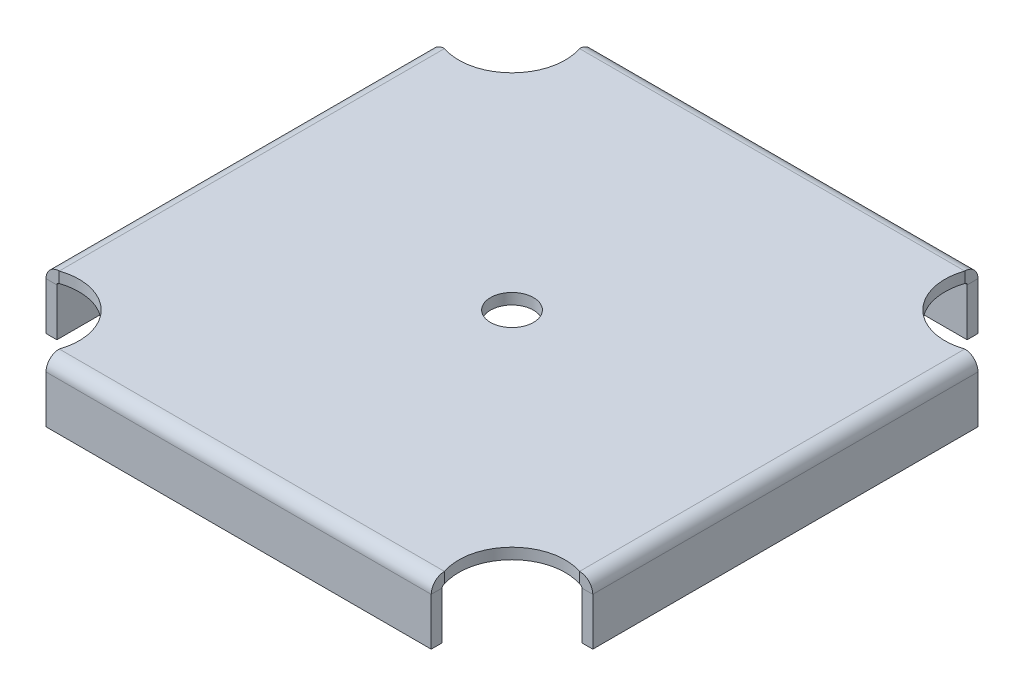
ISO-10303-21;
HEADER;
FILE_DESCRIPTION(('STEP AP214'),'2;1');
FILE_NAME('part.step','',(''),(''),'','','');
FILE_SCHEMA(('AUTOMOTIVE_DESIGN { 1 0 10303 214 1 1 1 1 }'));
ENDSEC;
DATA;
#1=APPLICATION_CONTEXT('core data for automotive mechanical design processes');
#2=APPLICATION_PROTOCOL_DEFINITION('international standard','automotive_design',2000,#1);
#3=PRODUCT_CONTEXT('',#1,'mechanical');
#4=PRODUCT('Part','Part','',(#3));
#5=PRODUCT_RELATED_PRODUCT_CATEGORY('part','',(#4));
#6=PRODUCT_DEFINITION_FORMATION('','',#4);
#7=PRODUCT_DEFINITION_CONTEXT('part definition',#1,'design');
#8=PRODUCT_DEFINITION('design','',#6,#7);
#9=PRODUCT_DEFINITION_SHAPE('','',#8);
#10=(LENGTH_UNIT() NAMED_UNIT(*) SI_UNIT(.MILLI.,.METRE.));
#11=(NAMED_UNIT(*) PLANE_ANGLE_UNIT() SI_UNIT($,.RADIAN.));
#12=(NAMED_UNIT(*) SI_UNIT($,.STERADIAN.) SOLID_ANGLE_UNIT());
#13=UNCERTAINTY_MEASURE_WITH_UNIT(LENGTH_MEASURE(1.E-05),#10,'distance_accuracy_value','');
#14=(GEOMETRIC_REPRESENTATION_CONTEXT(3) GLOBAL_UNCERTAINTY_ASSIGNED_CONTEXT((#13)) GLOBAL_UNIT_ASSIGNED_CONTEXT((#10,
#11,#12)) REPRESENTATION_CONTEXT('',''));
#15=CARTESIAN_POINT('',(0.,0.,0.));
#16=DIRECTION('',(0.,0.,1.));
#17=DIRECTION('',(1.,0.,0.));
#18=AXIS2_PLACEMENT_3D('',#15,#16,#17);
#19=CARTESIAN_POINT('',(76.2,-3.4163,76.2));
#20=DIRECTION('',(0.,1.,0.));
#21=DIRECTION('',(0.,0.,1.));
#22=AXIS2_PLACEMENT_3D('',#19,#20,#21);
#23=CYLINDRICAL_SURFACE('',#22,16.7005);
#24=CARTESIAN_POINT('',(76.2,0.,76.2));
#25=DIRECTION('',(0.,-1.,0.));
#26=DIRECTION('',(0.,0.,1.));
#27=AXIS2_PLACEMENT_3D('',#24,#25,#26);
#28=CIRCLE('',#27,16.7005);
#29=CARTESIAN_POINT('',(60.3828089759907,0.,81.5594));
#30=VERTEX_POINT('',#29);
#31=CARTESIAN_POINT('',(81.5594,0.,60.3828089759907));
#32=VERTEX_POINT('',#31);
#33=EDGE_CURVE('E469',#30,#32,#28,.T.);
#34=ORIENTED_EDGE('',*,*,#33,.F.);
#35=DIRECTION('',(0.,1.,0.));
#36=VECTOR('',#35,1.);
#37=CARTESIAN_POINT('',(60.3828089759907,-3.4163,81.5594));
#38=LINE('',#37,#36);
#39=CARTESIAN_POINT('',(60.3828089759907,-3.4163,81.5594));
#40=VERTEX_POINT('',#39);
#41=EDGE_CURVE('E13',#40,#30,#38,.T.);
#42=ORIENTED_EDGE('',*,*,#41,.F.);
#43=CARTESIAN_POINT('',(76.2,-3.4163,76.2));
#44=DIRECTION('',(0.,-1.,0.));
#45=DIRECTION('',(0.,0.,1.));
#46=AXIS2_PLACEMENT_3D('',#43,#44,#45);
#47=CIRCLE('',#46,16.7005);
#48=CARTESIAN_POINT('',(81.5594,-3.4163,60.3828089759907));
#49=VERTEX_POINT('',#48);
#50=EDGE_CURVE('E472',#40,#49,#47,.T.);
#51=ORIENTED_EDGE('',*,*,#50,.T.);
#52=DIRECTION('',(0.,1.,0.));
#53=VECTOR('',#52,1.);
#54=CARTESIAN_POINT('',(81.5594,-3.4163,60.3828089759907));
#55=LINE('',#54,#53);
#56=EDGE_CURVE('E126',#49,#32,#55,.T.);
#57=ORIENTED_EDGE('',*,*,#56,.T.);
#58=EDGE_LOOP('',(#34,#42,#51,#57));
#59=FACE_BOUND('',#58,.T.);
#60=ADVANCED_FACE('F123',(#59),#23,.F.);
#61=CARTESIAN_POINT('',(-76.2,-3.4163,76.2));
#62=DIRECTION('',(0.,1.,0.));
#63=DIRECTION('',(0.,0.,1.));
#64=AXIS2_PLACEMENT_3D('',#61,#62,#63);
#65=CYLINDRICAL_SURFACE('',#64,16.7005);
#66=CARTESIAN_POINT('',(-76.2,0.,76.2));
#67=DIRECTION('',(0.,-1.,0.));
#68=DIRECTION('',(0.,0.,1.));
#69=AXIS2_PLACEMENT_3D('',#66,#67,#68);
#70=CIRCLE('',#69,16.7005);
#71=CARTESIAN_POINT('',(-81.5594,0.,60.3828089759907));
#72=VERTEX_POINT('',#71);
#73=CARTESIAN_POINT('',(-60.3828089759907,0.,81.5594));
#74=VERTEX_POINT('',#73);
#75=EDGE_CURVE('E510',#72,#74,#70,.T.);
#76=ORIENTED_EDGE('',*,*,#75,.F.);
#77=DIRECTION('',(0.,1.,0.));
#78=VECTOR('',#77,1.);
#79=CARTESIAN_POINT('',(-81.5594,-3.4163,60.3828089759907));
#80=LINE('',#79,#78);
#81=CARTESIAN_POINT('',(-81.5594,-3.4163,60.3828089759907));
#82=VERTEX_POINT('',#81);
#83=EDGE_CURVE('E517',#82,#72,#80,.T.);
#84=ORIENTED_EDGE('',*,*,#83,.F.);
#85=CARTESIAN_POINT('',(-76.2,-3.4163,76.2));
#86=DIRECTION('',(0.,-1.,0.));
#87=DIRECTION('',(0.,0.,1.));
#88=AXIS2_PLACEMENT_3D('',#85,#86,#87);
#89=CIRCLE('',#88,16.7005);
#90=CARTESIAN_POINT('',(-60.3828089759907,-3.4163,81.5594));
#91=VERTEX_POINT('',#90);
#92=EDGE_CURVE('E488',#82,#91,#89,.T.);
#93=ORIENTED_EDGE('',*,*,#92,.T.);
#94=DIRECTION('',(0.,1.,0.));
#95=VECTOR('',#94,1.);
#96=CARTESIAN_POINT('',(-60.3828089759907,-3.4163,81.5594));
#97=LINE('',#96,#95);
#98=EDGE_CURVE('E131',#91,#74,#97,.T.);
#99=ORIENTED_EDGE('',*,*,#98,.T.);
#100=EDGE_LOOP('',(#76,#84,#93,#99));
#101=FACE_BOUND('',#100,.T.);
#102=ADVANCED_FACE('F549',(#101),#65,.F.);
#103=CARTESIAN_POINT('',(-76.2,-3.4163,-76.2));
#104=DIRECTION('',(0.,1.,0.));
#105=DIRECTION('',(0.,0.,1.));
#106=AXIS2_PLACEMENT_3D('',#103,#104,#105);
#107=CYLINDRICAL_SURFACE('',#106,16.7005);
#108=CARTESIAN_POINT('',(-76.2,0.,-76.2));
#109=DIRECTION('',(0.,-1.,0.));
#110=DIRECTION('',(0.,0.,1.));
#111=AXIS2_PLACEMENT_3D('',#108,#109,#110);
#112=CIRCLE('',#111,16.7005);
#113=CARTESIAN_POINT('',(-60.3828089759907,0.,-81.5594));
#114=VERTEX_POINT('',#113);
#115=CARTESIAN_POINT('',(-81.5594,0.,-60.3828089759907));
#116=VERTEX_POINT('',#115);
#117=EDGE_CURVE('E504',#114,#116,#112,.T.);
#118=ORIENTED_EDGE('',*,*,#117,.F.);
#119=DIRECTION('',(0.,1.,0.));
#120=VECTOR('',#119,1.);
#121=CARTESIAN_POINT('',(-60.3828089759907,-3.4163,-81.5594));
#122=LINE('',#121,#120);
#123=CARTESIAN_POINT('',(-60.3828089759907,-3.41630000000001,-81.5594));
#124=VERTEX_POINT('',#123);
#125=EDGE_CURVE('E522',#124,#114,#122,.T.);
#126=ORIENTED_EDGE('',*,*,#125,.F.);
#127=CARTESIAN_POINT('',(-76.2,-3.4163,-76.2));
#128=DIRECTION('',(0.,-1.,0.));
#129=DIRECTION('',(0.,0.,1.));
#130=AXIS2_PLACEMENT_3D('',#127,#128,#129);
#131=CIRCLE('',#130,16.7005);
#132=CARTESIAN_POINT('',(-81.5594,-3.4163,-60.3828089759907));
#133=VERTEX_POINT('',#132);
#134=EDGE_CURVE('E483',#124,#133,#131,.T.);
#135=ORIENTED_EDGE('',*,*,#134,.T.);
#136=DIRECTION('',(0.,1.,0.));
#137=VECTOR('',#136,1.);
#138=CARTESIAN_POINT('',(-81.5594,-3.4163,-60.3828089759907));
#139=LINE('',#138,#137);
#140=EDGE_CURVE('E519',#133,#116,#139,.T.);
#141=ORIENTED_EDGE('',*,*,#140,.T.);
#142=EDGE_LOOP('',(#118,#126,#135,#141));
#143=FACE_BOUND('',#142,.T.);
#144=ADVANCED_FACE('F595',(#143),#107,.F.);
#145=CARTESIAN_POINT('',(76.2,-3.4163,-76.2));
#146=DIRECTION('',(0.,1.,0.));
#147=DIRECTION('',(0.,0.,1.));
#148=AXIS2_PLACEMENT_3D('',#145,#146,#147);
#149=CYLINDRICAL_SURFACE('',#148,16.7005);
#150=CARTESIAN_POINT('',(76.2,0.,-76.2));
#151=DIRECTION('',(0.,-1.,0.));
#152=DIRECTION('',(0.,0.,1.));
#153=AXIS2_PLACEMENT_3D('',#150,#151,#152);
#154=CIRCLE('',#153,16.7005);
#155=CARTESIAN_POINT('',(81.5594,0.,-60.3828089759907));
#156=VERTEX_POINT('',#155);
#157=CARTESIAN_POINT('',(60.3828089759907,0.,-81.5594));
#158=VERTEX_POINT('',#157);
#159=EDGE_CURVE('E498',#156,#158,#154,.T.);
#160=ORIENTED_EDGE('',*,*,#159,.F.);
#161=DIRECTION('',(0.,1.,0.));
#162=VECTOR('',#161,1.);
#163=CARTESIAN_POINT('',(81.5594,-3.4163,-60.3828089759907));
#164=LINE('',#163,#162);
#165=CARTESIAN_POINT('',(81.5594,-3.4163,-60.3828089759907));
#166=VERTEX_POINT('',#165);
#167=EDGE_CURVE('E527',#166,#156,#164,.T.);
#168=ORIENTED_EDGE('',*,*,#167,.F.);
#169=CARTESIAN_POINT('',(76.2,-3.4163,-76.2));
#170=DIRECTION('',(0.,-1.,0.));
#171=DIRECTION('',(0.,0.,1.));
#172=AXIS2_PLACEMENT_3D('',#169,#170,#171);
#173=CIRCLE('',#172,16.7005);
#174=CARTESIAN_POINT('',(60.3828089759907,-3.41630000000001,-81.5594));
#175=VERTEX_POINT('',#174);
#176=EDGE_CURVE('E478',#166,#175,#173,.T.);
#177=ORIENTED_EDGE('',*,*,#176,.T.);
#178=DIRECTION('',(0.,1.,0.));
#179=VECTOR('',#178,1.);
#180=CARTESIAN_POINT('',(60.3828089759907,-3.4163,-81.5594));
#181=LINE('',#180,#179);
#182=EDGE_CURVE('E525',#175,#158,#181,.T.);
#183=ORIENTED_EDGE('',*,*,#182,.T.);
#184=EDGE_LOOP('',(#160,#168,#177,#183));
#185=FACE_BOUND('',#184,.T.);
#186=ADVANCED_FACE('F600',(#185),#149,.F.);
#187=CARTESIAN_POINT('',(76.2,-3.4163,76.2));
#188=DIRECTION('',(0.,1.,0.));
#189=DIRECTION('',(0.,0.,1.));
#190=AXIS2_PLACEMENT_3D('',#187,#188,#189);
#191=PLANE('',#190);
#192=CARTESIAN_POINT('',(0.,-3.4163,0.));
#193=DIRECTION('',(0.,1.,0.));
#194=DIRECTION('',(0.,0.,1.));
#195=AXIS2_PLACEMENT_3D('',#192,#193,#194);
#196=CIRCLE('',#195,6.7437);
#197=CARTESIAN_POINT('',(0.,-3.4163,6.7437));
#198=VERTEX_POINT('',#197);
#199=EDGE_CURVE('E466',#198,#198,#196,.T.);
#200=ORIENTED_EDGE('',*,*,#199,.T.);
#201=EDGE_LOOP('',(#200));
#202=FACE_BOUND('',#201,.T.);
#203=ORIENTED_EDGE('',*,*,#50,.F.);
#204=DIRECTION('',(1.,0.,0.));
#205=VECTOR('',#204,1.);
#206=CARTESIAN_POINT('',(60.3828089759907,-3.4163,81.5594));
#207=LINE('',#206,#205);
#208=EDGE_CURVE('E491',#91,#40,#207,.T.);
#209=ORIENTED_EDGE('',*,*,#208,.F.);
#210=ORIENTED_EDGE('',*,*,#92,.F.);
#211=DIRECTION('',(0.,0.,1.));
#212=VECTOR('',#211,1.);
#213=CARTESIAN_POINT('',(-81.5594,-3.4163,60.3828089759907));
#214=LINE('',#213,#212);
#215=EDGE_CURVE('E486',#133,#82,#214,.T.);
#216=ORIENTED_EDGE('',*,*,#215,.F.);
#217=ORIENTED_EDGE('',*,*,#134,.F.);
#218=DIRECTION('',(-1.,0.,0.));
#219=VECTOR('',#218,1.);
#220=CARTESIAN_POINT('',(-60.3828089759907,-3.4163,-81.5594));
#221=LINE('',#220,#219);
#222=EDGE_CURVE('E481',#175,#124,#221,.T.);
#223=ORIENTED_EDGE('',*,*,#222,.F.);
#224=ORIENTED_EDGE('',*,*,#176,.F.);
#225=DIRECTION('',(0.,0.,-1.));
#226=VECTOR('',#225,1.);
#227=CARTESIAN_POINT('',(81.5594,-3.4163,-60.3828089759907));
#228=LINE('',#227,#226);
#229=EDGE_CURVE('E475',#49,#166,#228,.T.);
#230=ORIENTED_EDGE('',*,*,#229,.F.);
#231=EDGE_LOOP('',(#203,#209,#210,#216,#217,#223,#224,#230));
#232=FACE_BOUND('',#231,.T.);
#233=ADVANCED_FACE('F555',(#202,#232),#191,.F.);
#234=CARTESIAN_POINT('',(76.2,0.,76.2));
#235=DIRECTION('',(0.,1.,0.));
#236=DIRECTION('',(0.,0.,1.));
#237=AXIS2_PLACEMENT_3D('',#234,#235,#236);
#238=PLANE('',#237);
#239=CARTESIAN_POINT('',(0.,0.,0.));
#240=DIRECTION('',(0.,1.,0.));
#241=DIRECTION('',(0.,0.,1.));
#242=AXIS2_PLACEMENT_3D('',#239,#240,#241);
#243=CIRCLE('',#242,6.7437);
#244=CARTESIAN_POINT('',(0.,0.,6.7437));
#245=VERTEX_POINT('',#244);
#246=EDGE_CURVE('E457',#245,#245,#243,.T.);
#247=ORIENTED_EDGE('',*,*,#246,.F.);
#248=EDGE_LOOP('',(#247));
#249=FACE_BOUND('',#248,.T.);
#250=ORIENTED_EDGE('',*,*,#33,.T.);
#251=DIRECTION('',(0.,0.,-1.));
#252=VECTOR('',#251,1.);
#253=CARTESIAN_POINT('',(81.5594,0.,-60.3828089759907));
#254=LINE('',#253,#252);
#255=EDGE_CURVE('E495',#32,#156,#254,.T.);
#256=ORIENTED_EDGE('',*,*,#255,.T.);
#257=ORIENTED_EDGE('',*,*,#159,.T.);
#258=DIRECTION('',(-1.,0.,0.));
#259=VECTOR('',#258,1.);
#260=CARTESIAN_POINT('',(-60.3828089759907,0.,-81.5594));
#261=LINE('',#260,#259);
#262=EDGE_CURVE('E501',#158,#114,#261,.T.);
#263=ORIENTED_EDGE('',*,*,#262,.T.);
#264=ORIENTED_EDGE('',*,*,#117,.T.);
#265=DIRECTION('',(0.,0.,1.));
#266=VECTOR('',#265,1.);
#267=CARTESIAN_POINT('',(-81.5594,0.,60.3828089759907));
#268=LINE('',#267,#266);
#269=EDGE_CURVE('E507',#116,#72,#268,.T.);
#270=ORIENTED_EDGE('',*,*,#269,.T.);
#271=ORIENTED_EDGE('',*,*,#75,.T.);
#272=DIRECTION('',(1.,0.,0.));
#273=VECTOR('',#272,1.);
#274=CARTESIAN_POINT('',(60.3828089759907,0.,81.5594));
#275=LINE('',#274,#273);
#276=EDGE_CURVE('E476',#74,#30,#275,.T.);
#277=ORIENTED_EDGE('',*,*,#276,.T.);
#278=EDGE_LOOP('',(#250,#256,#257,#263,#264,#270,#271,#277));
#279=FACE_BOUND('',#278,.T.);
#280=ADVANCED_FACE('F541',(#249,#279),#238,.T.);
#281=CARTESIAN_POINT('',(0.,-3.4163,0.));
#282=DIRECTION('',(0.,1.,0.));
#283=DIRECTION('',(0.,0.,1.));
#284=AXIS2_PLACEMENT_3D('',#281,#282,#283);
#285=CYLINDRICAL_SURFACE('',#284,6.7437);
#286=ORIENTED_EDGE('',*,*,#199,.F.);
#287=EDGE_LOOP('',(#286));
#288=FACE_BOUND('',#287,.T.);
#289=ORIENTED_EDGE('',*,*,#246,.T.);
#290=EDGE_LOOP('',(#289));
#291=FACE_BOUND('',#290,.T.);
#292=ADVANCED_FACE('F714',(#288,#291),#285,.F.);
#293=CARTESIAN_POINT('',(60.3828089759907,-4.1529,81.5594));
#294=DIRECTION('',(1.,0.,0.));
#295=DIRECTION('',(0.,0.,-1.));
#296=AXIS2_PLACEMENT_3D('',#293,#294,#295);
#297=PLANE('',#296);
#298=DIRECTION('',(0.,0.,1.));
#299=VECTOR('',#298,1.);
#300=CARTESIAN_POINT('',(60.3828089759907,-4.1529,85.7123));
#301=LINE('',#300,#299);
#302=CARTESIAN_POINT('',(60.3828089759907,-4.1529,82.296));
#303=VERTEX_POINT('',#302);
#304=CARTESIAN_POINT('',(60.3828089759907,-4.15289999999999,85.7123));
#305=VERTEX_POINT('',#304);
#306=EDGE_CURVE('E415',#303,#305,#301,.T.);
#307=ORIENTED_EDGE('',*,*,#306,.F.);
#308=CARTESIAN_POINT('',(60.3828089759907,-4.1529,81.5594));
#309=DIRECTION('',(-1.,0.,0.));
#310=DIRECTION('',(0.,0.,1.));
#311=AXIS2_PLACEMENT_3D('',#308,#309,#310);
#312=CIRCLE('',#311,0.736600000000004);
#313=EDGE_CURVE('E461',#40,#303,#312,.F.);
#314=ORIENTED_EDGE('',*,*,#313,.F.);
#315=ORIENTED_EDGE('',*,*,#41,.T.);
#316=CARTESIAN_POINT('',(60.3828089759907,-4.1529,81.5594));
#317=DIRECTION('',(-1.,0.,0.));
#318=DIRECTION('',(0.,0.,1.));
#319=AXIS2_PLACEMENT_3D('',#316,#317,#318);
#320=CIRCLE('',#319,4.1529);
#321=EDGE_CURVE('E139',#30,#305,#320,.F.);
#322=ORIENTED_EDGE('',*,*,#321,.T.);
#323=EDGE_LOOP('',(#307,#314,#315,#322));
#324=FACE_BOUND('',#323,.T.);
#325=ADVANCED_FACE('F562',(#324),#297,.T.);
#326=CARTESIAN_POINT('',(-60.3828089759907,-4.1529,81.5594));
#327=DIRECTION('',(1.,0.,0.));
#328=DIRECTION('',(0.,0.,-1.));
#329=AXIS2_PLACEMENT_3D('',#326,#327,#328);
#330=PLANE('',#329);
#331=CARTESIAN_POINT('',(-60.3828089759907,-4.1529,81.5594));
#332=DIRECTION('',(-1.,0.,0.));
#333=DIRECTION('',(0.,0.,1.));
#334=AXIS2_PLACEMENT_3D('',#331,#332,#333);
#335=CIRCLE('',#334,0.736600000000004);
#336=CARTESIAN_POINT('',(-60.3828089759907,-4.1529,82.296));
#337=VERTEX_POINT('',#336);
#338=EDGE_CURVE('E426',#337,#91,#335,.T.);
#339=ORIENTED_EDGE('',*,*,#338,.F.);
#340=DIRECTION('',(0.,0.,1.));
#341=VECTOR('',#340,1.);
#342=CARTESIAN_POINT('',(-60.3828089759907,-4.1529,82.296));
#343=LINE('',#342,#341);
#344=CARTESIAN_POINT('',(-60.3828089759907,-4.1529,85.7123));
#345=VERTEX_POINT('',#344);
#346=EDGE_CURVE('E449',#337,#345,#343,.T.);
#347=ORIENTED_EDGE('',*,*,#346,.T.);
#348=CARTESIAN_POINT('',(-60.3828089759907,-4.1529,81.5594));
#349=DIRECTION('',(-1.,0.,0.));
#350=DIRECTION('',(0.,0.,1.));
#351=AXIS2_PLACEMENT_3D('',#348,#349,#350);
#352=CIRCLE('',#351,4.1529);
#353=EDGE_CURVE('E458',#345,#74,#352,.T.);
#354=ORIENTED_EDGE('',*,*,#353,.T.);
#355=ORIENTED_EDGE('',*,*,#98,.F.);
#356=EDGE_LOOP('',(#339,#347,#354,#355));
#357=FACE_BOUND('',#356,.T.);
#358=ADVANCED_FACE('F546',(#357),#330,.F.);
#359=CARTESIAN_POINT('',(-60.3828089759907,-4.1529,81.5594));
#360=DIRECTION('',(-1.,0.,0.));
#361=DIRECTION('',(0.,0.,1.));
#362=AXIS2_PLACEMENT_3D('',#359,#360,#361);
#363=CYLINDRICAL_SURFACE('',#362,4.1529);
#364=ORIENTED_EDGE('',*,*,#276,.F.);
#365=ORIENTED_EDGE('',*,*,#353,.F.);
#366=DIRECTION('',(-1.,0.,0.));
#367=VECTOR('',#366,1.);
#368=CARTESIAN_POINT('',(0.,-4.1529,85.7123));
#369=LINE('',#368,#367);
#370=EDGE_CURVE('E446',#305,#345,#369,.T.);
#371=ORIENTED_EDGE('',*,*,#370,.F.);
#372=ORIENTED_EDGE('',*,*,#321,.F.);
#373=EDGE_LOOP('',(#364,#365,#371,#372));
#374=FACE_BOUND('',#373,.T.);
#375=ADVANCED_FACE('F543',(#374),#363,.T.);
#376=CARTESIAN_POINT('',(-60.3828089759907,-4.1529,81.5594));
#377=DIRECTION('',(-1.,0.,0.));
#378=DIRECTION('',(0.,0.,1.));
#379=AXIS2_PLACEMENT_3D('',#376,#377,#378);
#380=CYLINDRICAL_SURFACE('',#379,0.736600000000004);
#381=ORIENTED_EDGE('',*,*,#208,.T.);
#382=ORIENTED_EDGE('',*,*,#313,.T.);
#383=DIRECTION('',(1.,0.,0.));
#384=VECTOR('',#383,1.);
#385=CARTESIAN_POINT('',(60.3828089759907,-4.1529,82.296));
#386=LINE('',#385,#384);
#387=EDGE_CURVE('E452',#303,#337,#386,.F.);
#388=ORIENTED_EDGE('',*,*,#387,.T.);
#389=ORIENTED_EDGE('',*,*,#338,.T.);
#390=EDGE_LOOP('',(#381,#382,#388,#389));
#391=FACE_BOUND('',#390,.T.);
#392=ADVANCED_FACE('F559',(#391),#380,.F.);
#393=CARTESIAN_POINT('',(-60.3828089759907,-3.41629999999999,85.7123));
#394=DIRECTION('',(-1.,0.,0.));
#395=DIRECTION('',(0.,0.,1.));
#396=AXIS2_PLACEMENT_3D('',#393,#394,#395);
#397=PLANE('',#396);
#398=DIRECTION('',(0.,1.,0.));
#399=VECTOR('',#398,1.);
#400=CARTESIAN_POINT('',(-60.3828089759907,-3.41629999999999,85.7123));
#401=LINE('',#400,#399);
#402=CARTESIAN_POINT('',(-60.3828089759907,-19.05,85.7123));
#403=VERTEX_POINT('',#402);
#404=EDGE_CURVE('E430',#403,#345,#401,.T.);
#405=ORIENTED_EDGE('',*,*,#404,.T.);
#406=ORIENTED_EDGE('',*,*,#346,.F.);
#407=DIRECTION('',(0.,-1.,0.));
#408=VECTOR('',#407,1.);
#409=CARTESIAN_POINT('',(-60.3828089759907,2.17196961742773E-13,82.296));
#410=LINE('',#409,#408);
#411=CARTESIAN_POINT('',(-60.3828089759907,-19.05,82.296));
#412=VERTEX_POINT('',#411);
#413=EDGE_CURVE('E438',#412,#337,#410,.F.);
#414=ORIENTED_EDGE('',*,*,#413,.F.);
#415=DIRECTION('',(0.,0.,-1.));
#416=VECTOR('',#415,1.);
#417=CARTESIAN_POINT('',(-60.3828089759907,-19.05,85.7123));
#418=LINE('',#417,#416);
#419=EDGE_CURVE('E424',#403,#412,#418,.T.);
#420=ORIENTED_EDGE('',*,*,#419,.F.);
#421=EDGE_LOOP('',(#405,#406,#414,#420));
#422=FACE_BOUND('',#421,.T.);
#423=ADVANCED_FACE('F579',(#422),#397,.T.);
#424=CARTESIAN_POINT('',(60.3828089759907,-19.05,85.7123));
#425=DIRECTION('',(1.,0.,0.));
#426=DIRECTION('',(0.,0.,-1.));
#427=AXIS2_PLACEMENT_3D('',#424,#425,#426);
#428=PLANE('',#427);
#429=DIRECTION('',(0.,1.,0.));
#430=VECTOR('',#429,1.);
#431=CARTESIAN_POINT('',(60.3828089759907,2.17196961742773E-13,82.296));
#432=LINE('',#431,#430);
#433=CARTESIAN_POINT('',(60.3828089759907,-19.05,82.296));
#434=VERTEX_POINT('',#433);
#435=EDGE_CURVE('E444',#303,#434,#432,.F.);
#436=ORIENTED_EDGE('',*,*,#435,.F.);
#437=ORIENTED_EDGE('',*,*,#306,.T.);
#438=DIRECTION('',(0.,-1.,0.));
#439=VECTOR('',#438,1.);
#440=CARTESIAN_POINT('',(60.3828089759907,-19.05,85.7123));
#441=LINE('',#440,#439);
#442=CARTESIAN_POINT('',(60.3828089759907,-19.05,85.7123));
#443=VERTEX_POINT('',#442);
#444=EDGE_CURVE('E436',#305,#443,#441,.T.);
#445=ORIENTED_EDGE('',*,*,#444,.T.);
#446=DIRECTION('',(0.,0.,-1.));
#447=VECTOR('',#446,1.);
#448=CARTESIAN_POINT('',(60.3828089759907,-19.05,85.7123));
#449=LINE('',#448,#447);
#450=EDGE_CURVE('E427',#443,#434,#449,.T.);
#451=ORIENTED_EDGE('',*,*,#450,.T.);
#452=EDGE_LOOP('',(#436,#437,#445,#451));
#453=FACE_BOUND('',#452,.T.);
#454=ADVANCED_FACE('F566',(#453),#428,.T.);
#455=CARTESIAN_POINT('',(0.,2.29124909440663E-13,85.7123));
#456=DIRECTION('',(0.,0.,1.));
#457=DIRECTION('',(0.,-1.,0.));
#458=AXIS2_PLACEMENT_3D('',#455,#456,#457);
#459=PLANE('',#458);
#460=ORIENTED_EDGE('',*,*,#444,.F.);
#461=ORIENTED_EDGE('',*,*,#370,.T.);
#462=ORIENTED_EDGE('',*,*,#404,.F.);
#463=DIRECTION('',(-1.,0.,0.));
#464=VECTOR('',#463,1.);
#465=CARTESIAN_POINT('',(-60.3828089759907,-19.05,85.7123));
#466=LINE('',#465,#464);
#467=EDGE_CURVE('E433',#443,#403,#466,.T.);
#468=ORIENTED_EDGE('',*,*,#467,.F.);
#469=EDGE_LOOP('',(#460,#461,#462,#468));
#470=FACE_BOUND('',#469,.T.);
#471=ADVANCED_FACE('F570',(#470),#459,.T.);
#472=CARTESIAN_POINT('',(0.,2.17196961742773E-13,82.296));
#473=DIRECTION('',(0.,0.,1.));
#474=DIRECTION('',(0.,-1.,0.));
#475=AXIS2_PLACEMENT_3D('',#472,#473,#474);
#476=PLANE('',#475);
#477=ORIENTED_EDGE('',*,*,#387,.F.);
#478=ORIENTED_EDGE('',*,*,#435,.T.);
#479=DIRECTION('',(1.,0.,0.));
#480=VECTOR('',#479,1.);
#481=CARTESIAN_POINT('',(0.,-19.05,82.296));
#482=LINE('',#481,#480);
#483=EDGE_CURVE('E441',#434,#412,#482,.F.);
#484=ORIENTED_EDGE('',*,*,#483,.T.);
#485=ORIENTED_EDGE('',*,*,#413,.T.);
#486=EDGE_LOOP('',(#477,#478,#484,#485));
#487=FACE_BOUND('',#486,.T.);
#488=ADVANCED_FACE('F577',(#487),#476,.F.);
#489=CARTESIAN_POINT('',(-60.3828089759907,-19.05,85.7123));
#490=DIRECTION('',(0.,-1.,0.));
#491=DIRECTION('',(0.,0.,-1.));
#492=AXIS2_PLACEMENT_3D('',#489,#490,#491);
#493=PLANE('',#492);
#494=ORIENTED_EDGE('',*,*,#483,.F.);
#495=ORIENTED_EDGE('',*,*,#450,.F.);
#496=ORIENTED_EDGE('',*,*,#467,.T.);
#497=ORIENTED_EDGE('',*,*,#419,.T.);
#498=EDGE_LOOP('',(#494,#495,#496,#497));
#499=FACE_BOUND('',#498,.T.);
#500=ADVANCED_FACE('F574',(#499),#493,.T.);
#501=CARTESIAN_POINT('',(81.5594,-4.1529,-60.3828089759907));
#502=DIRECTION('',(0.,0.,-1.));
#503=DIRECTION('',(-1.,0.,0.));
#504=AXIS2_PLACEMENT_3D('',#501,#502,#503);
#505=PLANE('',#504);
#506=DIRECTION('',(1.,0.,0.));
#507=VECTOR('',#506,1.);
#508=CARTESIAN_POINT('',(85.7123,-4.15289999999999,-60.3828089759907));
#509=LINE('',#508,#507);
#510=CARTESIAN_POINT('',(82.296,-4.1529,-60.3828089759907));
#511=VERTEX_POINT('',#510);
#512=CARTESIAN_POINT('',(85.7123,-4.15289999999999,-60.3828089759907));
#513=VERTEX_POINT('',#512);
#514=EDGE_CURVE('E372',#511,#513,#509,.T.);
#515=ORIENTED_EDGE('',*,*,#514,.F.);
#516=CARTESIAN_POINT('',(81.5594,-4.1529,-60.3828089759907));
#517=DIRECTION('',(0.,0.,1.));
#518=DIRECTION('',(1.,0.,0.));
#519=AXIS2_PLACEMENT_3D('',#516,#517,#518);
#520=CIRCLE('',#519,0.736600000000004);
#521=EDGE_CURVE('E419',#166,#511,#520,.F.);
#522=ORIENTED_EDGE('',*,*,#521,.F.);
#523=ORIENTED_EDGE('',*,*,#167,.T.);
#524=CARTESIAN_POINT('',(81.5594,-4.1529,-60.3828089759907));
#525=DIRECTION('',(0.,0.,1.));
#526=DIRECTION('',(1.,0.,0.));
#527=AXIS2_PLACEMENT_3D('',#524,#525,#526);
#528=CIRCLE('',#527,4.1529);
#529=EDGE_CURVE('E412',#156,#513,#528,.F.);
#530=ORIENTED_EDGE('',*,*,#529,.T.);
#531=EDGE_LOOP('',(#515,#522,#523,#530));
#532=FACE_BOUND('',#531,.T.);
#533=ADVANCED_FACE('F697',(#532),#505,.T.);
#534=CARTESIAN_POINT('',(81.5594,-4.1529,60.3828089759907));
#535=DIRECTION('',(0.,0.,-1.));
#536=DIRECTION('',(-1.,0.,0.));
#537=AXIS2_PLACEMENT_3D('',#534,#535,#536);
#538=PLANE('',#537);
#539=CARTESIAN_POINT('',(81.5594,-4.1529,60.3828089759907));
#540=DIRECTION('',(0.,0.,1.));
#541=DIRECTION('',(1.,0.,0.));
#542=AXIS2_PLACEMENT_3D('',#539,#540,#541);
#543=CIRCLE('',#542,0.736600000000004);
#544=CARTESIAN_POINT('',(82.296,-4.1529,60.3828089759907));
#545=VERTEX_POINT('',#544);
#546=EDGE_CURVE('E383',#545,#49,#543,.T.);
#547=ORIENTED_EDGE('',*,*,#546,.F.);
#548=DIRECTION('',(1.,0.,0.));
#549=VECTOR('',#548,1.);
#550=CARTESIAN_POINT('',(82.296,-4.1529,60.3828089759907));
#551=LINE('',#550,#549);
#552=CARTESIAN_POINT('',(85.7123,-4.15289999999999,60.3828089759907));
#553=VERTEX_POINT('',#552);
#554=EDGE_CURVE('E405',#545,#553,#551,.T.);
#555=ORIENTED_EDGE('',*,*,#554,.T.);
#556=CARTESIAN_POINT('',(81.5594,-4.1529,60.3828089759907));
#557=DIRECTION('',(0.,0.,1.));
#558=DIRECTION('',(1.,0.,0.));
#559=AXIS2_PLACEMENT_3D('',#556,#557,#558);
#560=CIRCLE('',#559,4.1529);
#561=EDGE_CURVE('E416',#553,#32,#560,.T.);
#562=ORIENTED_EDGE('',*,*,#561,.T.);
#563=ORIENTED_EDGE('',*,*,#56,.F.);
#564=EDGE_LOOP('',(#547,#555,#562,#563));
#565=FACE_BOUND('',#564,.T.);
#566=ADVANCED_FACE('F692',(#565),#538,.F.);
#567=CARTESIAN_POINT('',(81.5594,-4.1529,60.3828089759907));
#568=DIRECTION('',(0.,0.,1.));
#569=DIRECTION('',(1.,0.,0.));
#570=AXIS2_PLACEMENT_3D('',#567,#568,#569);
#571=CYLINDRICAL_SURFACE('',#570,4.1529);
#572=ORIENTED_EDGE('',*,*,#255,.F.);
#573=ORIENTED_EDGE('',*,*,#561,.F.);
#574=DIRECTION('',(0.,0.,1.));
#575=VECTOR('',#574,1.);
#576=CARTESIAN_POINT('',(85.7123,-4.15289999999999,-60.3828089759907));
#577=LINE('',#576,#575);
#578=EDGE_CURVE('E403',#553,#513,#577,.F.);
#579=ORIENTED_EDGE('',*,*,#578,.T.);
#580=ORIENTED_EDGE('',*,*,#529,.F.);
#581=EDGE_LOOP('',(#572,#573,#579,#580));
#582=FACE_BOUND('',#581,.T.);
#583=ADVANCED_FACE('F689',(#582),#571,.T.);
#584=CARTESIAN_POINT('',(81.5594,-4.1529,60.3828089759907));
#585=DIRECTION('',(0.,0.,1.));
#586=DIRECTION('',(1.,0.,0.));
#587=AXIS2_PLACEMENT_3D('',#584,#585,#586);
#588=CYLINDRICAL_SURFACE('',#587,0.736600000000004);
#589=ORIENTED_EDGE('',*,*,#229,.T.);
#590=ORIENTED_EDGE('',*,*,#521,.T.);
#591=DIRECTION('',(0.,0.,1.));
#592=VECTOR('',#591,1.);
#593=CARTESIAN_POINT('',(82.296,-4.1529,-60.3828089759907));
#594=LINE('',#593,#592);
#595=EDGE_CURVE('E408',#511,#545,#594,.T.);
#596=ORIENTED_EDGE('',*,*,#595,.T.);
#597=ORIENTED_EDGE('',*,*,#546,.T.);
#598=EDGE_LOOP('',(#589,#590,#596,#597));
#599=FACE_BOUND('',#598,.T.);
#600=ADVANCED_FACE('F687',(#599),#588,.F.);
#601=CARTESIAN_POINT('',(85.7123,-3.41629999999999,-60.3828089759907));
#602=DIRECTION('',(0.,0.,-1.));
#603=DIRECTION('',(-1.,0.,0.));
#604=AXIS2_PLACEMENT_3D('',#601,#602,#603);
#605=PLANE('',#604);
#606=DIRECTION('',(0.,-1.,0.));
#607=VECTOR('',#606,1.);
#608=CARTESIAN_POINT('',(82.296,2.89595948990364E-13,-60.3828089759907));
#609=LINE('',#608,#607);
#610=CARTESIAN_POINT('',(82.2960000000001,-19.05,-60.3828089759907));
#611=VERTEX_POINT('',#610);
#612=EDGE_CURVE('E401',#511,#611,#609,.T.);
#613=ORIENTED_EDGE('',*,*,#612,.F.);
#614=ORIENTED_EDGE('',*,*,#514,.T.);
#615=DIRECTION('',(0.,1.,0.));
#616=VECTOR('',#615,1.);
#617=CARTESIAN_POINT('',(85.7123,-3.41629999999999,-60.3828089759907));
#618=LINE('',#617,#616);
#619=CARTESIAN_POINT('',(85.7123000000001,-19.05,-60.3828089759907));
#620=VERTEX_POINT('',#619);
#621=EDGE_CURVE('E393',#513,#620,#618,.F.);
#622=ORIENTED_EDGE('',*,*,#621,.T.);
#623=DIRECTION('',(-1.,0.,0.));
#624=VECTOR('',#623,1.);
#625=CARTESIAN_POINT('',(85.7123000000001,-19.05,-60.3828089759907));
#626=LINE('',#625,#624);
#627=EDGE_CURVE('E384',#620,#611,#626,.T.);
#628=ORIENTED_EDGE('',*,*,#627,.T.);
#629=EDGE_LOOP('',(#613,#614,#622,#628));
#630=FACE_BOUND('',#629,.T.);
#631=ADVANCED_FACE('F680',(#630),#605,.T.);
#632=CARTESIAN_POINT('',(85.7123000000001,-19.05,60.3828089759907));
#633=DIRECTION('',(0.,0.,1.));
#634=DIRECTION('',(0.,-1.,0.));
#635=AXIS2_PLACEMENT_3D('',#632,#633,#634);
#636=PLANE('',#635);
#637=DIRECTION('',(0.,-1.,0.));
#638=VECTOR('',#637,1.);
#639=CARTESIAN_POINT('',(85.7123000000001,-19.05,60.3828089759907));
#640=LINE('',#639,#638);
#641=CARTESIAN_POINT('',(85.7123000000001,-19.05,60.3828089759907));
#642=VERTEX_POINT('',#641);
#643=EDGE_CURVE('E387',#642,#553,#640,.F.);
#644=ORIENTED_EDGE('',*,*,#643,.T.);
#645=ORIENTED_EDGE('',*,*,#554,.F.);
#646=DIRECTION('',(0.,1.,0.));
#647=VECTOR('',#646,1.);
#648=CARTESIAN_POINT('',(82.296,3.16396380436809E-13,60.3828089759907));
#649=LINE('',#648,#647);
#650=CARTESIAN_POINT('',(82.2960000000001,-19.05,60.3828089759907));
#651=VERTEX_POINT('',#650);
#652=EDGE_CURVE('E395',#651,#545,#649,.T.);
#653=ORIENTED_EDGE('',*,*,#652,.F.);
#654=DIRECTION('',(-1.,0.,0.));
#655=VECTOR('',#654,1.);
#656=CARTESIAN_POINT('',(85.7123000000001,-19.05,60.3828089759907));
#657=LINE('',#656,#655);
#658=EDGE_CURVE('E381',#642,#651,#657,.T.);
#659=ORIENTED_EDGE('',*,*,#658,.F.);
#660=EDGE_LOOP('',(#644,#645,#653,#659));
#661=FACE_BOUND('',#660,.T.);
#662=ADVANCED_FACE('F673',(#661),#636,.T.);
#663=CARTESIAN_POINT('',(85.7123,3.01523896688254E-13,0.));
#664=DIRECTION('',(-1.,0.,0.));
#665=DIRECTION('',(0.,-1.,0.));
#666=AXIS2_PLACEMENT_3D('',#663,#664,#665);
#667=PLANE('',#666);
#668=ORIENTED_EDGE('',*,*,#578,.F.);
#669=ORIENTED_EDGE('',*,*,#643,.F.);
#670=DIRECTION('',(0.,0.,-1.));
#671=VECTOR('',#670,1.);
#672=CARTESIAN_POINT('',(85.7123000000001,-19.05,-60.3828089759907));
#673=LINE('',#672,#671);
#674=EDGE_CURVE('E390',#620,#642,#673,.F.);
#675=ORIENTED_EDGE('',*,*,#674,.F.);
#676=ORIENTED_EDGE('',*,*,#621,.F.);
#677=EDGE_LOOP('',(#668,#669,#675,#676));
#678=FACE_BOUND('',#677,.T.);
#679=ADVANCED_FACE('F669',(#678),#667,.F.);
#680=CARTESIAN_POINT('',(82.296,2.89595948990364E-13,0.));
#681=DIRECTION('',(-1.,0.,0.));
#682=DIRECTION('',(0.,-1.,0.));
#683=AXIS2_PLACEMENT_3D('',#680,#681,#682);
#684=PLANE('',#683);
#685=ORIENTED_EDGE('',*,*,#652,.T.);
#686=ORIENTED_EDGE('',*,*,#595,.F.);
#687=ORIENTED_EDGE('',*,*,#612,.T.);
#688=DIRECTION('',(0.,0.,1.));
#689=VECTOR('',#688,1.);
#690=CARTESIAN_POINT('',(82.2960000000001,-19.05,0.));
#691=LINE('',#690,#689);
#692=EDGE_CURVE('E398',#611,#651,#691,.T.);
#693=ORIENTED_EDGE('',*,*,#692,.T.);
#694=EDGE_LOOP('',(#685,#686,#687,#693));
#695=FACE_BOUND('',#694,.T.);
#696=ADVANCED_FACE('F672',(#695),#684,.T.);
#697=CARTESIAN_POINT('',(85.7123000000001,-19.05,-60.3828089759907));
#698=DIRECTION('',(0.,-1.,0.));
#699=DIRECTION('',(1.,0.,0.));
#700=AXIS2_PLACEMENT_3D('',#697,#698,#699);
#701=PLANE('',#700);
#702=ORIENTED_EDGE('',*,*,#692,.F.);
#703=ORIENTED_EDGE('',*,*,#627,.F.);
#704=ORIENTED_EDGE('',*,*,#674,.T.);
#705=ORIENTED_EDGE('',*,*,#658,.T.);
#706=EDGE_LOOP('',(#702,#703,#704,#705));
#707=FACE_BOUND('',#706,.T.);
#708=ADVANCED_FACE('F666',(#707),#701,.T.);
#709=CARTESIAN_POINT('',(-60.3828089759907,-4.15290000000001,-81.5594));
#710=DIRECTION('',(-1.,0.,0.));
#711=DIRECTION('',(0.,0.,1.));
#712=AXIS2_PLACEMENT_3D('',#709,#710,#711);
#713=PLANE('',#712);
#714=DIRECTION('',(0.,0.,-1.));
#715=VECTOR('',#714,1.);
#716=CARTESIAN_POINT('',(-60.3828089759907,-4.15289999999998,-85.7123));
#717=LINE('',#716,#715);
#718=CARTESIAN_POINT('',(-60.3828089759907,-4.15290000000001,-82.296));
#719=VERTEX_POINT('',#718);
#720=CARTESIAN_POINT('',(-60.3828089759907,-4.1529,-85.7123));
#721=VERTEX_POINT('',#720);
#722=EDGE_CURVE('E329',#719,#721,#717,.T.);
#723=ORIENTED_EDGE('',*,*,#722,.F.);
#724=CARTESIAN_POINT('',(-60.3828089759907,-4.15290000000001,-81.5594));
#725=DIRECTION('',(1.,0.,0.));
#726=DIRECTION('',(0.,0.,-1.));
#727=AXIS2_PLACEMENT_3D('',#724,#725,#726);
#728=CIRCLE('',#727,0.736600000000004);
#729=EDGE_CURVE('E376',#124,#719,#728,.F.);
#730=ORIENTED_EDGE('',*,*,#729,.F.);
#731=ORIENTED_EDGE('',*,*,#125,.T.);
#732=CARTESIAN_POINT('',(-60.3828089759907,-4.15290000000001,-81.5594));
#733=DIRECTION('',(1.,0.,0.));
#734=DIRECTION('',(0.,0.,-1.));
#735=AXIS2_PLACEMENT_3D('',#732,#733,#734);
#736=CIRCLE('',#735,4.1529);
#737=EDGE_CURVE('E369',#114,#721,#736,.F.);
#738=ORIENTED_EDGE('',*,*,#737,.T.);
#739=EDGE_LOOP('',(#723,#730,#731,#738));
#740=FACE_BOUND('',#739,.T.);
#741=ADVANCED_FACE('F637',(#740),#713,.T.);
#742=CARTESIAN_POINT('',(60.3828089759907,-4.15290000000001,-81.5594));
#743=DIRECTION('',(-1.,0.,0.));
#744=DIRECTION('',(0.,0.,1.));
#745=AXIS2_PLACEMENT_3D('',#742,#743,#744);
#746=PLANE('',#745);
#747=CARTESIAN_POINT('',(60.3828089759907,-4.15290000000001,-81.5594));
#748=DIRECTION('',(1.,0.,0.));
#749=DIRECTION('',(0.,0.,-1.));
#750=AXIS2_PLACEMENT_3D('',#747,#748,#749);
#751=CIRCLE('',#750,0.736600000000004);
#752=CARTESIAN_POINT('',(60.3828089759907,-4.15290000000001,-82.296));
#753=VERTEX_POINT('',#752);
#754=EDGE_CURVE('E340',#753,#175,#751,.T.);
#755=ORIENTED_EDGE('',*,*,#754,.F.);
#756=DIRECTION('',(0.,0.,-1.));
#757=VECTOR('',#756,1.);
#758=CARTESIAN_POINT('',(60.3828089759907,-4.15290000000001,-82.296));
#759=LINE('',#758,#757);
#760=CARTESIAN_POINT('',(60.3828089759907,-4.15289999999999,-85.7123));
#761=VERTEX_POINT('',#760);
#762=EDGE_CURVE('E362',#753,#761,#759,.T.);
#763=ORIENTED_EDGE('',*,*,#762,.T.);
#764=CARTESIAN_POINT('',(60.3828089759907,-4.15290000000001,-81.5594));
#765=DIRECTION('',(1.,0.,0.));
#766=DIRECTION('',(0.,0.,-1.));
#767=AXIS2_PLACEMENT_3D('',#764,#765,#766);
#768=CIRCLE('',#767,4.1529);
#769=EDGE_CURVE('E373',#761,#158,#768,.T.);
#770=ORIENTED_EDGE('',*,*,#769,.T.);
#771=ORIENTED_EDGE('',*,*,#182,.F.);
#772=EDGE_LOOP('',(#755,#763,#770,#771));
#773=FACE_BOUND('',#772,.T.);
#774=ADVANCED_FACE('F617',(#773),#746,.F.);
#775=CARTESIAN_POINT('',(60.3828089759907,-4.15290000000001,-81.5594));
#776=DIRECTION('',(1.,0.,0.));
#777=DIRECTION('',(0.,0.,-1.));
#778=AXIS2_PLACEMENT_3D('',#775,#776,#777);
#779=CYLINDRICAL_SURFACE('',#778,4.1529);
#780=ORIENTED_EDGE('',*,*,#262,.F.);
#781=ORIENTED_EDGE('',*,*,#769,.F.);
#782=DIRECTION('',(1.,0.,0.));
#783=VECTOR('',#782,1.);
#784=CARTESIAN_POINT('',(-60.3828089759907,-4.15289999999998,-85.7123));
#785=LINE('',#784,#783);
#786=EDGE_CURVE('E360',#761,#721,#785,.F.);
#787=ORIENTED_EDGE('',*,*,#786,.T.);
#788=ORIENTED_EDGE('',*,*,#737,.F.);
#789=EDGE_LOOP('',(#780,#781,#787,#788));
#790=FACE_BOUND('',#789,.T.);
#791=ADVANCED_FACE('F614',(#790),#779,.T.);
#792=CARTESIAN_POINT('',(60.3828089759907,-4.15290000000001,-81.5594));
#793=DIRECTION('',(1.,0.,0.));
#794=DIRECTION('',(0.,0.,-1.));
#795=AXIS2_PLACEMENT_3D('',#792,#793,#794);
#796=CYLINDRICAL_SURFACE('',#795,0.736600000000004);
#797=ORIENTED_EDGE('',*,*,#222,.T.);
#798=ORIENTED_EDGE('',*,*,#729,.T.);
#799=DIRECTION('',(1.,0.,0.));
#800=VECTOR('',#799,1.);
#801=CARTESIAN_POINT('',(-60.3828089759907,-4.1529,-82.296));
#802=LINE('',#801,#800);
#803=EDGE_CURVE('E365',#719,#753,#802,.T.);
#804=ORIENTED_EDGE('',*,*,#803,.T.);
#805=ORIENTED_EDGE('',*,*,#754,.T.);
#806=EDGE_LOOP('',(#797,#798,#804,#805));
#807=FACE_BOUND('',#806,.T.);
#808=ADVANCED_FACE('F641',(#807),#796,.F.);
#809=CARTESIAN_POINT('',(-60.3828089759907,-3.41629999999999,-85.7123));
#810=DIRECTION('',(-1.,0.,0.));
#811=DIRECTION('',(0.,0.,1.));
#812=AXIS2_PLACEMENT_3D('',#809,#810,#811);
#813=PLANE('',#812);
#814=DIRECTION('',(0.,-1.,0.));
#815=VECTOR('',#814,1.);
#816=CARTESIAN_POINT('',(-60.3828089759907,2.89595948990364E-13,-82.296));
#817=LINE('',#816,#815);
#818=CARTESIAN_POINT('',(-60.3828089759907,-19.05,-82.296));
#819=VERTEX_POINT('',#818);
#820=EDGE_CURVE('E358',#719,#819,#817,.T.);
#821=ORIENTED_EDGE('',*,*,#820,.F.);
#822=ORIENTED_EDGE('',*,*,#722,.T.);
#823=DIRECTION('',(0.,1.,0.));
#824=VECTOR('',#823,1.);
#825=CARTESIAN_POINT('',(-60.3828089759907,-3.41629999999999,-85.7123));
#826=LINE('',#825,#824);
#827=CARTESIAN_POINT('',(-60.3828089759907,-19.05,-85.7123));
#828=VERTEX_POINT('',#827);
#829=EDGE_CURVE('E350',#721,#828,#826,.F.);
#830=ORIENTED_EDGE('',*,*,#829,.T.);
#831=DIRECTION('',(0.,0.,1.));
#832=VECTOR('',#831,1.);
#833=CARTESIAN_POINT('',(-60.3828089759907,-19.05,-85.7123));
#834=LINE('',#833,#832);
#835=EDGE_CURVE('E341',#828,#819,#834,.T.);
#836=ORIENTED_EDGE('',*,*,#835,.T.);
#837=EDGE_LOOP('',(#821,#822,#830,#836));
#838=FACE_BOUND('',#837,.T.);
#839=ADVANCED_FACE('F634',(#838),#813,.T.);
#840=CARTESIAN_POINT('',(60.3828089759907,-19.05,-85.7123));
#841=DIRECTION('',(1.,0.,0.));
#842=DIRECTION('',(0.,1.,0.));
#843=AXIS2_PLACEMENT_3D('',#840,#841,#842);
#844=PLANE('',#843);
#845=DIRECTION('',(0.,-1.,0.));
#846=VECTOR('',#845,1.);
#847=CARTESIAN_POINT('',(60.3828089759907,-19.05,-85.7123));
#848=LINE('',#847,#846);
#849=CARTESIAN_POINT('',(60.3828089759907,-19.05,-85.7123));
#850=VERTEX_POINT('',#849);
#851=EDGE_CURVE('E344',#850,#761,#848,.F.);
#852=ORIENTED_EDGE('',*,*,#851,.T.);
#853=ORIENTED_EDGE('',*,*,#762,.F.);
#854=DIRECTION('',(0.,1.,0.));
#855=VECTOR('',#854,1.);
#856=CARTESIAN_POINT('',(60.3828089759907,3.16396380436809E-13,-82.2959999999999));
#857=LINE('',#856,#855);
#858=CARTESIAN_POINT('',(60.3828089759907,-19.05,-82.296));
#859=VERTEX_POINT('',#858);
#860=EDGE_CURVE('E352',#859,#753,#857,.T.);
#861=ORIENTED_EDGE('',*,*,#860,.F.);
#862=DIRECTION('',(0.,0.,1.));
#863=VECTOR('',#862,1.);
#864=CARTESIAN_POINT('',(60.3828089759907,-19.05,-85.7123));
#865=LINE('',#864,#863);
#866=EDGE_CURVE('E338',#850,#859,#865,.T.);
#867=ORIENTED_EDGE('',*,*,#866,.F.);
#868=EDGE_LOOP('',(#852,#853,#861,#867));
#869=FACE_BOUND('',#868,.T.);
#870=ADVANCED_FACE('F627',(#869),#844,.T.);
#871=CARTESIAN_POINT('',(0.,3.01523896688253E-13,-85.7123));
#872=DIRECTION('',(0.,0.,1.));
#873=DIRECTION('',(0.,-1.,0.));
#874=AXIS2_PLACEMENT_3D('',#871,#872,#873);
#875=PLANE('',#874);
#876=ORIENTED_EDGE('',*,*,#786,.F.);
#877=ORIENTED_EDGE('',*,*,#851,.F.);
#878=DIRECTION('',(-1.,0.,0.));
#879=VECTOR('',#878,1.);
#880=CARTESIAN_POINT('',(-60.3828089759907,-19.05,-85.7123));
#881=LINE('',#880,#879);
#882=EDGE_CURVE('E347',#828,#850,#881,.F.);
#883=ORIENTED_EDGE('',*,*,#882,.F.);
#884=ORIENTED_EDGE('',*,*,#829,.F.);
#885=EDGE_LOOP('',(#876,#877,#883,#884));
#886=FACE_BOUND('',#885,.T.);
#887=ADVANCED_FACE('F625',(#886),#875,.F.);
#888=CARTESIAN_POINT('',(0.,2.89595948990364E-13,-82.296));
#889=DIRECTION('',(0.,0.,1.));
#890=DIRECTION('',(0.,-1.,0.));
#891=AXIS2_PLACEMENT_3D('',#888,#889,#890);
#892=PLANE('',#891);
#893=ORIENTED_EDGE('',*,*,#860,.T.);
#894=ORIENTED_EDGE('',*,*,#803,.F.);
#895=ORIENTED_EDGE('',*,*,#820,.T.);
#896=DIRECTION('',(1.,0.,0.));
#897=VECTOR('',#896,1.);
#898=CARTESIAN_POINT('',(0.,-19.05,-82.296));
#899=LINE('',#898,#897);
#900=EDGE_CURVE('E355',#819,#859,#899,.T.);
#901=ORIENTED_EDGE('',*,*,#900,.T.);
#902=EDGE_LOOP('',(#893,#894,#895,#901));
#903=FACE_BOUND('',#902,.T.);
#904=ADVANCED_FACE('F644',(#903),#892,.T.);
#905=CARTESIAN_POINT('',(-60.3828089759907,-19.05,-85.7123));
#906=DIRECTION('',(0.,-1.,0.));
#907=DIRECTION('',(0.,0.,-1.));
#908=AXIS2_PLACEMENT_3D('',#905,#906,#907);
#909=PLANE('',#908);
#910=ORIENTED_EDGE('',*,*,#900,.F.);
#911=ORIENTED_EDGE('',*,*,#835,.F.);
#912=ORIENTED_EDGE('',*,*,#882,.T.);
#913=ORIENTED_EDGE('',*,*,#866,.T.);
#914=EDGE_LOOP('',(#910,#911,#912,#913));
#915=FACE_BOUND('',#914,.T.);
#916=ADVANCED_FACE('F630',(#915),#909,.T.);
#917=CARTESIAN_POINT('',(-81.5594,-4.1529,60.3828089759907));
#918=DIRECTION('',(0.,0.,1.));
#919=DIRECTION('',(1.,0.,0.));
#920=AXIS2_PLACEMENT_3D('',#917,#918,#919);
#921=PLANE('',#920);
#922=DIRECTION('',(-1.,0.,0.));
#923=VECTOR('',#922,1.);
#924=CARTESIAN_POINT('',(-85.7123,-4.15289999999999,60.3828089759907));
#925=LINE('',#924,#923);
#926=CARTESIAN_POINT('',(-82.296,-4.1529,60.3828089759907));
#927=VERTEX_POINT('',#926);
#928=CARTESIAN_POINT('',(-85.7123,-4.15289999999999,60.3828089759907));
#929=VERTEX_POINT('',#928);
#930=EDGE_CURVE('E325',#927,#929,#925,.T.);
#931=ORIENTED_EDGE('',*,*,#930,.F.);
#932=CARTESIAN_POINT('',(-81.5594,-4.1529,60.3828089759907));
#933=DIRECTION('',(0.,0.,-1.));
#934=DIRECTION('',(-1.,0.,0.));
#935=AXIS2_PLACEMENT_3D('',#932,#933,#934);
#936=CIRCLE('',#935,0.736600000000004);
#937=EDGE_CURVE('E333',#82,#927,#936,.F.);
#938=ORIENTED_EDGE('',*,*,#937,.F.);
#939=ORIENTED_EDGE('',*,*,#83,.T.);
#940=CARTESIAN_POINT('',(-81.5594,-4.1529,60.3828089759907));
#941=DIRECTION('',(0.,0.,-1.));
#942=DIRECTION('',(-1.,0.,0.));
#943=AXIS2_PLACEMENT_3D('',#940,#941,#942);
#944=CIRCLE('',#943,4.1529);
#945=EDGE_CURVE('E146',#72,#929,#944,.F.);
#946=ORIENTED_EDGE('',*,*,#945,.T.);
#947=EDGE_LOOP('',(#931,#938,#939,#946));
#948=FACE_BOUND('',#947,.T.);
#949=ADVANCED_FACE('F651',(#948),#921,.T.);
#950=CARTESIAN_POINT('',(-81.5594,-4.1529,-60.3828089759907));
#951=DIRECTION('',(0.,0.,1.));
#952=DIRECTION('',(1.,0.,0.));
#953=AXIS2_PLACEMENT_3D('',#950,#951,#952);
#954=PLANE('',#953);
#955=CARTESIAN_POINT('',(-81.5594,-4.1529,-60.3828089759907));
#956=DIRECTION('',(0.,0.,-1.));
#957=DIRECTION('',(-1.,0.,0.));
#958=AXIS2_PLACEMENT_3D('',#955,#956,#957);
#959=CIRCLE('',#958,0.736600000000004);
#960=CARTESIAN_POINT('',(-82.296,-4.1529,-60.3828089759907));
#961=VERTEX_POINT('',#960);
#962=EDGE_CURVE('E295',#961,#133,#959,.T.);
#963=ORIENTED_EDGE('',*,*,#962,.F.);
#964=DIRECTION('',(-1.,0.,0.));
#965=VECTOR('',#964,1.);
#966=CARTESIAN_POINT('',(-82.296,-4.1529,-60.3828089759907));
#967=LINE('',#966,#965);
#968=CARTESIAN_POINT('',(-85.7123,-4.15289999999999,-60.3828089759907));
#969=VERTEX_POINT('',#968);
#970=EDGE_CURVE('E320',#961,#969,#967,.T.);
#971=ORIENTED_EDGE('',*,*,#970,.T.);
#972=CARTESIAN_POINT('',(-81.5594,-4.1529,-60.3828089759907));
#973=DIRECTION('',(0.,0.,-1.));
#974=DIRECTION('',(-1.,0.,0.));
#975=AXIS2_PLACEMENT_3D('',#972,#973,#974);
#976=CIRCLE('',#975,4.1529);
#977=EDGE_CURVE('E330',#969,#116,#976,.T.);
#978=ORIENTED_EDGE('',*,*,#977,.T.);
#979=ORIENTED_EDGE('',*,*,#140,.F.);
#980=EDGE_LOOP('',(#963,#971,#978,#979));
#981=FACE_BOUND('',#980,.T.);
#982=ADVANCED_FACE('F889',(#981),#954,.F.);
#983=CARTESIAN_POINT('',(-81.5594,-4.1529,-60.3828089759907));
#984=DIRECTION('',(0.,0.,-1.));
#985=DIRECTION('',(-1.,0.,0.));
#986=AXIS2_PLACEMENT_3D('',#983,#984,#985);
#987=CYLINDRICAL_SURFACE('',#986,4.1529);
#988=ORIENTED_EDGE('',*,*,#269,.F.);
#989=ORIENTED_EDGE('',*,*,#977,.F.);
#990=DIRECTION('',(0.,0.,-1.));
#991=VECTOR('',#990,1.);
#992=CARTESIAN_POINT('',(-85.7123,-4.15289999999999,60.3828089759907));
#993=LINE('',#992,#991);
#994=EDGE_CURVE('E304',#969,#929,#993,.F.);
#995=ORIENTED_EDGE('',*,*,#994,.T.);
#996=ORIENTED_EDGE('',*,*,#945,.F.);
#997=EDGE_LOOP('',(#988,#989,#995,#996));
#998=FACE_BOUND('',#997,.T.);
#999=ADVANCED_FACE('F899',(#998),#987,.T.);
#1000=CARTESIAN_POINT('',(-81.5594,-4.1529,-60.3828089759907));
#1001=DIRECTION('',(0.,0.,-1.));
#1002=DIRECTION('',(-1.,0.,0.));
#1003=AXIS2_PLACEMENT_3D('',#1000,#1001,#1002);
#1004=CYLINDRICAL_SURFACE('',#1003,0.736600000000004);
#1005=ORIENTED_EDGE('',*,*,#215,.T.);
#1006=ORIENTED_EDGE('',*,*,#937,.T.);
#1007=DIRECTION('',(0.,0.,-1.));
#1008=VECTOR('',#1007,1.);
#1009=CARTESIAN_POINT('',(-82.296,-4.1529,60.3828089759907));
#1010=LINE('',#1009,#1008);
#1011=EDGE_CURVE('E323',#927,#961,#1010,.T.);
#1012=ORIENTED_EDGE('',*,*,#1011,.T.);
#1013=ORIENTED_EDGE('',*,*,#962,.T.);
#1014=EDGE_LOOP('',(#1005,#1006,#1012,#1013));
#1015=FACE_BOUND('',#1014,.T.);
#1016=ADVANCED_FACE('F908',(#1015),#1004,.F.);
#1017=CARTESIAN_POINT('',(-85.7123,-3.41629999999999,60.3828089759907));
#1018=DIRECTION('',(0.,0.,1.));
#1019=DIRECTION('',(1.,0.,0.));
#1020=AXIS2_PLACEMENT_3D('',#1017,#1018,#1019);
#1021=PLANE('',#1020);
#1022=DIRECTION('',(0.,-1.,0.));
#1023=VECTOR('',#1022,1.);
#1024=CARTESIAN_POINT('',(-82.2959999999999,2.89595948990364E-13,60.3828089759907));
#1025=LINE('',#1024,#1023);
#1026=CARTESIAN_POINT('',(-82.296,-19.05,60.3828089759907));
#1027=VERTEX_POINT('',#1026);
#1028=EDGE_CURVE('E317',#927,#1027,#1025,.T.);
#1029=ORIENTED_EDGE('',*,*,#1028,.F.);
#1030=ORIENTED_EDGE('',*,*,#930,.T.);
#1031=DIRECTION('',(0.,1.,0.));
#1032=VECTOR('',#1031,1.);
#1033=CARTESIAN_POINT('',(-85.7123,-3.41629999999999,60.3828089759907));
#1034=LINE('',#1033,#1032);
#1035=CARTESIAN_POINT('',(-85.7123,-19.05,60.3828089759907));
#1036=VERTEX_POINT('',#1035);
#1037=EDGE_CURVE('E309',#929,#1036,#1034,.F.);
#1038=ORIENTED_EDGE('',*,*,#1037,.T.);
#1039=DIRECTION('',(1.,0.,0.));
#1040=VECTOR('',#1039,1.);
#1041=CARTESIAN_POINT('',(-85.7123,-19.05,60.3828089759907));
#1042=LINE('',#1041,#1040);
#1043=EDGE_CURVE('E296',#1036,#1027,#1042,.T.);
#1044=ORIENTED_EDGE('',*,*,#1043,.T.);
#1045=EDGE_LOOP('',(#1029,#1030,#1038,#1044));
#1046=FACE_BOUND('',#1045,.T.);
#1047=ADVANCED_FACE('F917',(#1046),#1021,.T.);
#1048=CARTESIAN_POINT('',(-85.7123,-19.05,-60.3828089759907));
#1049=DIRECTION('',(0.,0.,-1.));
#1050=DIRECTION('',(0.,1.,0.));
#1051=AXIS2_PLACEMENT_3D('',#1048,#1049,#1050);
#1052=PLANE('',#1051);
#1053=DIRECTION('',(0.,-1.,0.));
#1054=VECTOR('',#1053,1.);
#1055=CARTESIAN_POINT('',(-85.7123,-19.05,-60.3828089759907));
#1056=LINE('',#1055,#1054);
#1057=CARTESIAN_POINT('',(-85.7123,-19.05,-60.3828089759907));
#1058=VERTEX_POINT('',#1057);
#1059=EDGE_CURVE('E288',#1058,#969,#1056,.F.);
#1060=ORIENTED_EDGE('',*,*,#1059,.T.);
#1061=ORIENTED_EDGE('',*,*,#970,.F.);
#1062=DIRECTION('',(0.,1.,0.));
#1063=VECTOR('',#1062,1.);
#1064=CARTESIAN_POINT('',(-82.2959999999999,3.16396380436809E-13,-60.3828089759907));
#1065=LINE('',#1064,#1063);
#1066=CARTESIAN_POINT('',(-82.296,-19.05,-60.3828089759907));
#1067=VERTEX_POINT('',#1066);
#1068=EDGE_CURVE('E290',#1067,#961,#1065,.T.);
#1069=ORIENTED_EDGE('',*,*,#1068,.F.);
#1070=DIRECTION('',(1.,0.,0.));
#1071=VECTOR('',#1070,1.);
#1072=CARTESIAN_POINT('',(-85.7123,-19.05,-60.3828089759907));
#1073=LINE('',#1072,#1071);
#1074=EDGE_CURVE('E284',#1058,#1067,#1073,.T.);
#1075=ORIENTED_EDGE('',*,*,#1074,.F.);
#1076=EDGE_LOOP('',(#1060,#1061,#1069,#1075));
#1077=FACE_BOUND('',#1076,.T.);
#1078=ADVANCED_FACE('F286',(#1077),#1052,.T.);
#1079=CARTESIAN_POINT('',(-85.7123,3.01523896688253E-13,0.));
#1080=DIRECTION('',(1.,0.,0.));
#1081=DIRECTION('',(0.,1.,0.));
#1082=AXIS2_PLACEMENT_3D('',#1079,#1080,#1081);
#1083=PLANE('',#1082);
#1084=ORIENTED_EDGE('',*,*,#994,.F.);
#1085=ORIENTED_EDGE('',*,*,#1059,.F.);
#1086=DIRECTION('',(0.,0.,1.));
#1087=VECTOR('',#1086,1.);
#1088=CARTESIAN_POINT('',(-85.7123,-19.05,60.3828089759907));
#1089=LINE('',#1088,#1087);
#1090=EDGE_CURVE('E303',#1036,#1058,#1089,.F.);
#1091=ORIENTED_EDGE('',*,*,#1090,.F.);
#1092=ORIENTED_EDGE('',*,*,#1037,.F.);
#1093=EDGE_LOOP('',(#1084,#1085,#1091,#1092));
#1094=FACE_BOUND('',#1093,.T.);
#1095=ADVANCED_FACE('F301',(#1094),#1083,.F.);
#1096=CARTESIAN_POINT('',(-82.2959999999999,2.89595948990364E-13,0.));
#1097=DIRECTION('',(1.,0.,0.));
#1098=DIRECTION('',(0.,1.,0.));
#1099=AXIS2_PLACEMENT_3D('',#1096,#1097,#1098);
#1100=PLANE('',#1099);
#1101=ORIENTED_EDGE('',*,*,#1068,.T.);
#1102=ORIENTED_EDGE('',*,*,#1011,.F.);
#1103=ORIENTED_EDGE('',*,*,#1028,.T.);
#1104=DIRECTION('',(0.,0.,-1.));
#1105=VECTOR('',#1104,1.);
#1106=CARTESIAN_POINT('',(-82.296,-19.05,0.));
#1107=LINE('',#1106,#1105);
#1108=EDGE_CURVE('E315',#1027,#1067,#1107,.T.);
#1109=ORIENTED_EDGE('',*,*,#1108,.T.);
#1110=EDGE_LOOP('',(#1101,#1102,#1103,#1109));
#1111=FACE_BOUND('',#1110,.T.);
#1112=ADVANCED_FACE('F944',(#1111),#1100,.T.);
#1113=CARTESIAN_POINT('',(-85.7123,-19.05,60.3828089759907));
#1114=DIRECTION('',(0.,-1.,0.));
#1115=DIRECTION('',(1.,0.,0.));
#1116=AXIS2_PLACEMENT_3D('',#1113,#1114,#1115);
#1117=PLANE('',#1116);
#1118=ORIENTED_EDGE('',*,*,#1108,.F.);
#1119=ORIENTED_EDGE('',*,*,#1043,.F.);
#1120=ORIENTED_EDGE('',*,*,#1090,.T.);
#1121=ORIENTED_EDGE('',*,*,#1074,.T.);
#1122=EDGE_LOOP('',(#1118,#1119,#1120,#1121));
#1123=FACE_BOUND('',#1122,.T.);
#1124=ADVANCED_FACE('F307',(#1123),#1117,.T.);
#1125=CLOSED_SHELL('',(#60,#102,#144,#186,#233,#280,#292,#325,#358,#375,#392,#423,#454,#471,
#488,#500,#533,#566,#583,#600,#631,#662,#679,#696,#708,#741,#774,#791,#808,#839,#870,#887,#904,
#916,#949,#982,#999,#1016,#1047,#1078,#1095,#1112,#1124));
#1126=MANIFOLD_SOLID_BREP('B2',#1125);
#1127=ADVANCED_BREP_SHAPE_REPRESENTATION('',(#18,#1126),#14);
#1128=SHAPE_DEFINITION_REPRESENTATION(#9,#1127);
ENDSEC;
END-ISO-10303-21;
